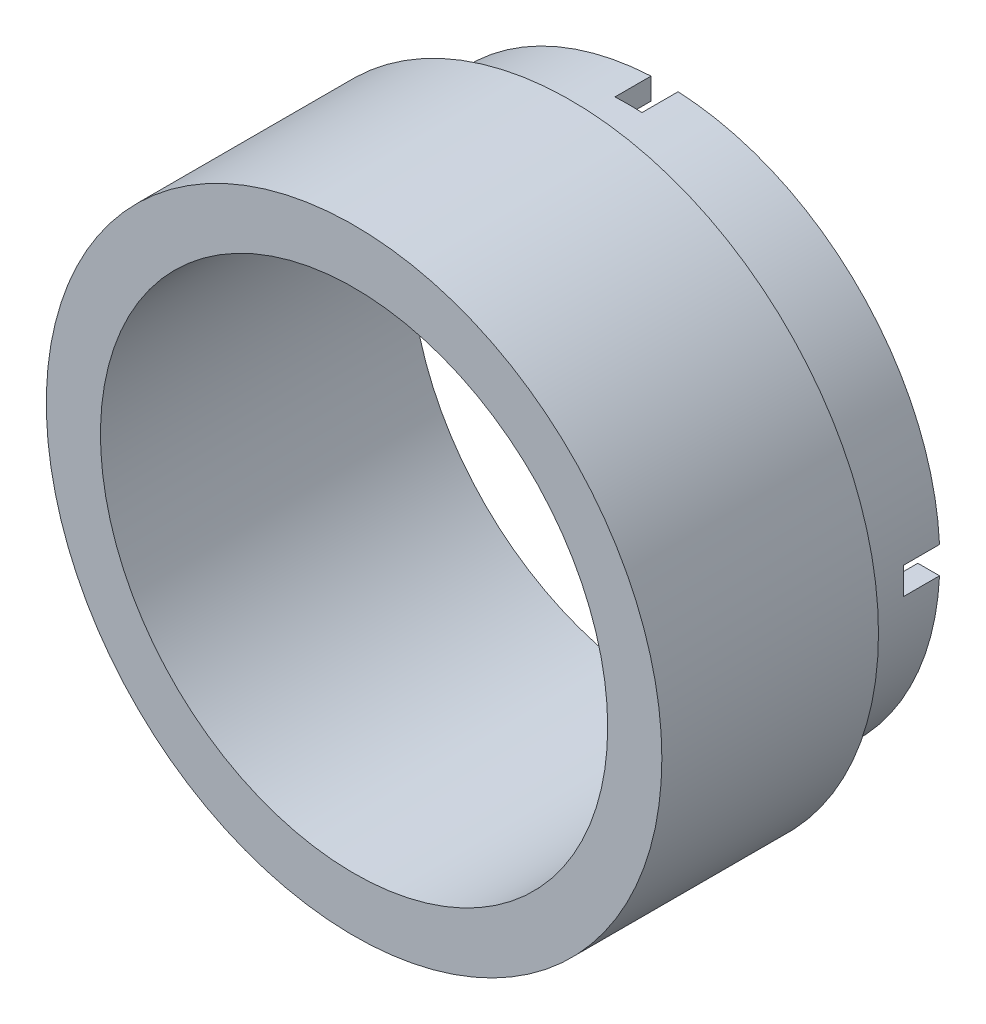
ISO-10303-21;
HEADER;
FILE_DESCRIPTION(('STEP AP214'),'2;1');
FILE_NAME('part.step','',(''),(''),'','','');
FILE_SCHEMA(('AUTOMOTIVE_DESIGN { 1 0 10303 214 1 1 1 1 }'));
ENDSEC;
DATA;
#1=APPLICATION_CONTEXT('core data for automotive mechanical design processes');
#2=APPLICATION_PROTOCOL_DEFINITION('international standard','automotive_design',2000,#1);
#3=PRODUCT_CONTEXT('',#1,'mechanical');
#4=PRODUCT('Part','Part','',(#3));
#5=PRODUCT_RELATED_PRODUCT_CATEGORY('part','',(#4));
#6=PRODUCT_DEFINITION_FORMATION('','',#4);
#7=PRODUCT_DEFINITION_CONTEXT('part definition',#1,'design');
#8=PRODUCT_DEFINITION('design','',#6,#7);
#9=PRODUCT_DEFINITION_SHAPE('','',#8);
#10=(LENGTH_UNIT() NAMED_UNIT(*) SI_UNIT(.MILLI.,.METRE.));
#11=(NAMED_UNIT(*) PLANE_ANGLE_UNIT() SI_UNIT($,.RADIAN.));
#12=(NAMED_UNIT(*) SI_UNIT($,.STERADIAN.) SOLID_ANGLE_UNIT());
#13=UNCERTAINTY_MEASURE_WITH_UNIT(LENGTH_MEASURE(1.E-05),#10,'distance_accuracy_value','');
#14=(GEOMETRIC_REPRESENTATION_CONTEXT(3) GLOBAL_UNCERTAINTY_ASSIGNED_CONTEXT((#13)) GLOBAL_UNIT_ASSIGNED_CONTEXT((#10,
#11,#12)) REPRESENTATION_CONTEXT('',''));
#15=CARTESIAN_POINT('',(0.,0.,0.));
#16=DIRECTION('',(0.,0.,1.));
#17=DIRECTION('',(1.,0.,0.));
#18=AXIS2_PLACEMENT_3D('',#15,#16,#17);
#19=CARTESIAN_POINT('',(0.,0.,0.));
#20=DIRECTION('',(0.,0.,1.));
#21=DIRECTION('',(1.,0.,0.));
#22=AXIS2_PLACEMENT_3D('',#19,#20,#21);
#23=PLANE('',#22);
#24=DIRECTION('',(0.,1.,0.));
#25=VECTOR('',#24,1.);
#26=CARTESIAN_POINT('',(0.749999999999999,-0.749999999999974,0.));
#27=LINE('',#26,#25);
#28=CARTESIAN_POINT('',(0.750000000000001,-15.2315462117278,0.));
#29=VERTEX_POINT('',#28);
#30=CARTESIAN_POINT('',(0.750000000000001,-14.0299679258365,0.));
#31=VERTEX_POINT('',#30);
#32=EDGE_CURVE('E152',#29,#31,#27,.T.);
#33=ORIENTED_EDGE('',*,*,#32,.T.);
#34=CARTESIAN_POINT('',(0.,0.,0.));
#35=DIRECTION('',(0.,0.,1.));
#36=DIRECTION('',(1.,0.,0.));
#37=AXIS2_PLACEMENT_3D('',#34,#35,#36);
#38=CIRCLE('',#37,14.05);
#39=CARTESIAN_POINT('',(14.0299679258365,-0.749999999999973,0.));
#40=VERTEX_POINT('',#39);
#41=EDGE_CURVE('E177',#31,#40,#38,.T.);
#42=ORIENTED_EDGE('',*,*,#41,.T.);
#43=DIRECTION('',(1.,0.,0.));
#44=VECTOR('',#43,1.);
#45=CARTESIAN_POINT('',(0.749999999999999,-0.749999999999974,0.));
#46=LINE('',#45,#44);
#47=CARTESIAN_POINT('',(15.2315462117278,-0.749999999999972,0.));
#48=VERTEX_POINT('',#47);
#49=EDGE_CURVE('E165',#40,#48,#46,.T.);
#50=ORIENTED_EDGE('',*,*,#49,.T.);
#51=CARTESIAN_POINT('',(0.,0.,0.));
#52=DIRECTION('',(0.,0.,1.));
#53=DIRECTION('',(1.,0.,0.));
#54=AXIS2_PLACEMENT_3D('',#51,#52,#53);
#55=CIRCLE('',#54,15.25);
#56=EDGE_CURVE('E173',#29,#48,#55,.T.);
#57=ORIENTED_EDGE('',*,*,#56,.F.);
#58=EDGE_LOOP('',(#33,#42,#50,#57));
#59=FACE_BOUND('',#58,.T.);
#60=ADVANCED_FACE('F39',(#59),#23,.F.);
#61=DIRECTION('',(-1.,0.,0.));
#62=VECTOR('',#61,1.);
#63=CARTESIAN_POINT('',(0.749999999999997,0.750000000000029,0.));
#64=LINE('',#63,#62);
#65=CARTESIAN_POINT('',(15.2315462117278,0.750000000000028,0.));
#66=VERTEX_POINT('',#65);
#67=CARTESIAN_POINT('',(14.0299679258365,0.750000000000028,0.));
#68=VERTEX_POINT('',#67);
#69=EDGE_CURVE('E298',#66,#68,#64,.T.);
#70=ORIENTED_EDGE('',*,*,#69,.T.);
#71=CARTESIAN_POINT('',(0.749999999999997,14.0299679258365,0.));
#72=VERTEX_POINT('',#71);
#73=EDGE_CURVE('E183',#68,#72,#38,.T.);
#74=ORIENTED_EDGE('',*,*,#73,.T.);
#75=DIRECTION('',(0.,1.,0.));
#76=VECTOR('',#75,1.);
#77=CARTESIAN_POINT('',(0.749999999999997,17.4512535008235,0.));
#78=LINE('',#77,#76);
#79=CARTESIAN_POINT('',(0.749999999999997,15.2315462117278,0.));
#80=VERTEX_POINT('',#79);
#81=EDGE_CURVE('E230',#72,#80,#78,.T.);
#82=ORIENTED_EDGE('',*,*,#81,.T.);
#83=EDGE_CURVE('E185',#66,#80,#55,.T.);
#84=ORIENTED_EDGE('',*,*,#83,.F.);
#85=EDGE_LOOP('',(#70,#74,#82,#84));
#86=FACE_BOUND('',#85,.T.);
#87=ADVANCED_FACE('F304',(#86),#23,.F.);
#88=DIRECTION('',(0.,-1.,0.));
#89=VECTOR('',#88,1.);
#90=CARTESIAN_POINT('',(-0.750000000000003,17.4512535008235,0.));
#91=LINE('',#90,#89);
#92=CARTESIAN_POINT('',(-0.750000000000003,15.2315462117278,0.));
#93=VERTEX_POINT('',#92);
#94=CARTESIAN_POINT('',(-0.750000000000003,14.0299679258365,0.));
#95=VERTEX_POINT('',#94);
#96=EDGE_CURVE('E217',#93,#95,#91,.T.);
#97=ORIENTED_EDGE('',*,*,#96,.T.);
#98=CARTESIAN_POINT('',(-14.0299679258365,0.750000000000028,0.));
#99=VERTEX_POINT('',#98);
#100=EDGE_CURVE('E191',#95,#99,#38,.T.);
#101=ORIENTED_EDGE('',*,*,#100,.T.);
#102=DIRECTION('',(-1.,0.,0.));
#103=VECTOR('',#102,1.);
#104=CARTESIAN_POINT('',(-21.8765202372286,0.750000000000028,0.));
#105=LINE('',#104,#103);
#106=CARTESIAN_POINT('',(-15.2315462117278,0.750000000000028,0.));
#107=VERTEX_POINT('',#106);
#108=EDGE_CURVE('E219',#99,#107,#105,.T.);
#109=ORIENTED_EDGE('',*,*,#108,.T.);
#110=EDGE_CURVE('E189',#93,#107,#55,.T.);
#111=ORIENTED_EDGE('',*,*,#110,.F.);
#112=EDGE_LOOP('',(#97,#101,#109,#111));
#113=FACE_BOUND('',#112,.T.);
#114=ADVANCED_FACE('F215',(#113),#23,.F.);
#115=DIRECTION('',(1.,0.,0.));
#116=VECTOR('',#115,1.);
#117=CARTESIAN_POINT('',(-21.8765202372286,-0.749999999999972,0.));
#118=LINE('',#117,#116);
#119=CARTESIAN_POINT('',(-15.2315462117278,-0.749999999999972,0.));
#120=VERTEX_POINT('',#119);
#121=CARTESIAN_POINT('',(-14.0299679258365,-0.749999999999972,0.));
#122=VERTEX_POINT('',#121);
#123=EDGE_CURVE('E223',#120,#122,#118,.T.);
#124=ORIENTED_EDGE('',*,*,#123,.T.);
#125=CARTESIAN_POINT('',(-0.749999999999999,-14.0299679258365,0.));
#126=VERTEX_POINT('',#125);
#127=EDGE_CURVE('E346',#122,#126,#38,.T.);
#128=ORIENTED_EDGE('',*,*,#127,.T.);
#129=DIRECTION('',(0.,-1.,0.));
#130=VECTOR('',#129,1.);
#131=CARTESIAN_POINT('',(-0.750000000000001,-0.749999999999972,0.));
#132=LINE('',#131,#130);
#133=CARTESIAN_POINT('',(-0.749999999999999,-15.2315462117278,0.));
#134=VERTEX_POINT('',#133);
#135=EDGE_CURVE('E228',#126,#134,#132,.T.);
#136=ORIENTED_EDGE('',*,*,#135,.T.);
#137=EDGE_CURVE('E182',#120,#134,#55,.T.);
#138=ORIENTED_EDGE('',*,*,#137,.F.);
#139=EDGE_LOOP('',(#124,#128,#136,#138));
#140=FACE_BOUND('',#139,.T.);
#141=ADVANCED_FACE('F353',(#140),#23,.F.);
#142=CARTESIAN_POINT('',(0.,0.,5.2));
#143=DIRECTION('',(0.,0.,-1.));
#144=DIRECTION('',(-1.,0.,0.));
#145=AXIS2_PLACEMENT_3D('',#142,#143,#144);
#146=CYLINDRICAL_SURFACE('',#145,15.25);
#147=CARTESIAN_POINT('',(0.,0.,5.2));
#148=DIRECTION('',(0.,0.,1.));
#149=DIRECTION('',(1.,0.,0.));
#150=AXIS2_PLACEMENT_3D('',#147,#148,#149);
#151=CIRCLE('',#150,15.25);
#152=CARTESIAN_POINT('',(15.25,0.,5.2));
#153=VERTEX_POINT('',#152);
#154=EDGE_CURVE('E197',#153,#153,#151,.T.);
#155=ORIENTED_EDGE('',*,*,#154,.F.);
#156=EDGE_LOOP('',(#155));
#157=FACE_BOUND('',#156,.T.);
#158=DIRECTION('',(0.,0.,-1.));
#159=VECTOR('',#158,1.);
#160=CARTESIAN_POINT('',(0.749999999999997,15.2315462117278,5.2));
#161=LINE('',#160,#159);
#162=CARTESIAN_POINT('',(0.749999999999997,15.2315462117278,2.));
#163=VERTEX_POINT('',#162);
#164=EDGE_CURVE('E254',#163,#80,#161,.T.);
#165=ORIENTED_EDGE('',*,*,#164,.F.);
#166=CARTESIAN_POINT('',(0.,0.,2.));
#167=DIRECTION('',(0.,0.,1.));
#168=DIRECTION('',(1.,0.,0.));
#169=AXIS2_PLACEMENT_3D('',#166,#167,#168);
#170=CIRCLE('',#169,15.25);
#171=CARTESIAN_POINT('',(-0.750000000000003,15.2315462117278,2.));
#172=VERTEX_POINT('',#171);
#173=EDGE_CURVE('E243',#163,#172,#170,.T.);
#174=ORIENTED_EDGE('',*,*,#173,.T.);
#175=DIRECTION('',(0.,0.,-1.));
#176=VECTOR('',#175,1.);
#177=CARTESIAN_POINT('',(-0.750000000000003,15.2315462117278,5.2));
#178=LINE('',#177,#176);
#179=EDGE_CURVE('E211',#93,#172,#178,.F.);
#180=ORIENTED_EDGE('',*,*,#179,.F.);
#181=ORIENTED_EDGE('',*,*,#110,.T.);
#182=DIRECTION('',(0.,0.,-1.));
#183=VECTOR('',#182,1.);
#184=CARTESIAN_POINT('',(-15.2315462117278,0.750000000000028,5.2));
#185=LINE('',#184,#183);
#186=CARTESIAN_POINT('',(-15.2315462117278,0.750000000000028,2.));
#187=VERTEX_POINT('',#186);
#188=EDGE_CURVE('E209',#187,#107,#185,.T.);
#189=ORIENTED_EDGE('',*,*,#188,.F.);
#190=CARTESIAN_POINT('',(-15.2315462117278,-0.749999999999972,2.));
#191=VERTEX_POINT('',#190);
#192=EDGE_CURVE('E354',#187,#191,#170,.T.);
#193=ORIENTED_EDGE('',*,*,#192,.T.);
#194=DIRECTION('',(0.,0.,-1.));
#195=VECTOR('',#194,1.);
#196=CARTESIAN_POINT('',(-15.2315462117278,-0.749999999999972,5.2));
#197=LINE('',#196,#195);
#198=EDGE_CURVE('E247',#120,#191,#197,.F.);
#199=ORIENTED_EDGE('',*,*,#198,.F.);
#200=ORIENTED_EDGE('',*,*,#137,.T.);
#201=DIRECTION('',(0.,0.,-1.));
#202=VECTOR('',#201,1.);
#203=CARTESIAN_POINT('',(-0.749999999999999,-15.2315462117278,5.2));
#204=LINE('',#203,#202);
#205=CARTESIAN_POINT('',(-0.749999999999999,-15.2315462117278,2.));
#206=VERTEX_POINT('',#205);
#207=EDGE_CURVE('E244',#206,#134,#204,.T.);
#208=ORIENTED_EDGE('',*,*,#207,.F.);
#209=CARTESIAN_POINT('',(0.750000000000001,-15.2315462117278,2.));
#210=VERTEX_POINT('',#209);
#211=EDGE_CURVE('E175',#206,#210,#170,.T.);
#212=ORIENTED_EDGE('',*,*,#211,.T.);
#213=DIRECTION('',(0.,0.,-1.));
#214=VECTOR('',#213,1.);
#215=CARTESIAN_POINT('',(0.750000000000001,-15.2315462117278,5.2));
#216=LINE('',#215,#214);
#217=EDGE_CURVE('E156',#29,#210,#216,.F.);
#218=ORIENTED_EDGE('',*,*,#217,.F.);
#219=ORIENTED_EDGE('',*,*,#56,.T.);
#220=DIRECTION('',(0.,0.,-1.));
#221=VECTOR('',#220,1.);
#222=CARTESIAN_POINT('',(15.2315462117278,-0.749999999999972,5.2));
#223=LINE('',#222,#221);
#224=CARTESIAN_POINT('',(15.2315462117278,-0.749999999999972,2.));
#225=VERTEX_POINT('',#224);
#226=EDGE_CURVE('E178',#225,#48,#223,.T.);
#227=ORIENTED_EDGE('',*,*,#226,.F.);
#228=CARTESIAN_POINT('',(15.2315462117278,0.750000000000028,2.));
#229=VERTEX_POINT('',#228);
#230=EDGE_CURVE('E238',#225,#229,#170,.T.);
#231=ORIENTED_EDGE('',*,*,#230,.T.);
#232=DIRECTION('',(0.,0.,-1.));
#233=VECTOR('',#232,1.);
#234=CARTESIAN_POINT('',(15.2315462117278,0.750000000000028,5.2));
#235=LINE('',#234,#233);
#236=EDGE_CURVE('E257',#66,#229,#235,.F.);
#237=ORIENTED_EDGE('',*,*,#236,.F.);
#238=ORIENTED_EDGE('',*,*,#83,.T.);
#239=EDGE_LOOP('',(#165,#174,#180,#181,#189,#193,#199,#200,#208,#212,#218,#219,#227,#231,#237,#238));
#240=FACE_BOUND('',#239,.T.);
#241=ADVANCED_FACE('F41',(#157,#240),#146,.T.);
#242=CARTESIAN_POINT('',(0.,0.,5.2));
#243=DIRECTION('',(0.,0.,-1.));
#244=DIRECTION('',(-1.,0.,0.));
#245=AXIS2_PLACEMENT_3D('',#242,#243,#244);
#246=CYLINDRICAL_SURFACE('',#245,14.05);
#247=CARTESIAN_POINT('',(0.,0.,2.));
#248=DIRECTION('',(0.,0.,1.));
#249=DIRECTION('',(1.,0.,0.));
#250=AXIS2_PLACEMENT_3D('',#247,#248,#249);
#251=CIRCLE('',#250,14.05);
#252=CARTESIAN_POINT('',(0.749999999999997,14.0299679258365,2.));
#253=VERTEX_POINT('',#252);
#254=CARTESIAN_POINT('',(-0.750000000000003,14.0299679258365,2.));
#255=VERTEX_POINT('',#254);
#256=EDGE_CURVE('E313',#253,#255,#251,.T.);
#257=ORIENTED_EDGE('',*,*,#256,.F.);
#258=DIRECTION('',(0.,0.,-1.));
#259=VECTOR('',#258,1.);
#260=CARTESIAN_POINT('',(0.749999999999997,14.0299679258365,5.2));
#261=LINE('',#260,#259);
#262=EDGE_CURVE('E11',#253,#72,#261,.T.);
#263=ORIENTED_EDGE('',*,*,#262,.T.);
#264=ORIENTED_EDGE('',*,*,#73,.F.);
#265=DIRECTION('',(0.,0.,-1.));
#266=VECTOR('',#265,1.);
#267=CARTESIAN_POINT('',(14.0299679258365,0.750000000000028,5.2));
#268=LINE('',#267,#266);
#269=CARTESIAN_POINT('',(14.0299679258365,0.750000000000028,2.));
#270=VERTEX_POINT('',#269);
#271=EDGE_CURVE('E326',#68,#270,#268,.F.);
#272=ORIENTED_EDGE('',*,*,#271,.T.);
#273=CARTESIAN_POINT('',(14.0299679258365,-0.749999999999973,2.));
#274=VERTEX_POINT('',#273);
#275=EDGE_CURVE('E203',#274,#270,#251,.T.);
#276=ORIENTED_EDGE('',*,*,#275,.F.);
#277=DIRECTION('',(0.,0.,-1.));
#278=VECTOR('',#277,1.);
#279=CARTESIAN_POINT('',(14.0299679258365,-0.749999999999973,5.2));
#280=LINE('',#279,#278);
#281=EDGE_CURVE('E328',#274,#40,#280,.T.);
#282=ORIENTED_EDGE('',*,*,#281,.T.);
#283=ORIENTED_EDGE('',*,*,#41,.F.);
#284=DIRECTION('',(0.,0.,-1.));
#285=VECTOR('',#284,1.);
#286=CARTESIAN_POINT('',(0.750000000000001,-14.0299679258365,5.2));
#287=LINE('',#286,#285);
#288=CARTESIAN_POINT('',(0.750000000000001,-14.0299679258365,2.));
#289=VERTEX_POINT('',#288);
#290=EDGE_CURVE('E159',#31,#289,#287,.F.);
#291=ORIENTED_EDGE('',*,*,#290,.T.);
#292=CARTESIAN_POINT('',(-0.749999999999999,-14.0299679258365,2.));
#293=VERTEX_POINT('',#292);
#294=EDGE_CURVE('E324',#293,#289,#251,.T.);
#295=ORIENTED_EDGE('',*,*,#294,.F.);
#296=DIRECTION('',(0.,0.,-1.));
#297=VECTOR('',#296,1.);
#298=CARTESIAN_POINT('',(-0.749999999999999,-14.0299679258365,5.2));
#299=LINE('',#298,#297);
#300=EDGE_CURVE('E330',#293,#126,#299,.T.);
#301=ORIENTED_EDGE('',*,*,#300,.T.);
#302=ORIENTED_EDGE('',*,*,#127,.F.);
#303=DIRECTION('',(0.,0.,-1.));
#304=VECTOR('',#303,1.);
#305=CARTESIAN_POINT('',(-14.0299679258365,-0.749999999999972,5.2));
#306=LINE('',#305,#304);
#307=CARTESIAN_POINT('',(-14.0299679258365,-0.749999999999972,2.));
#308=VERTEX_POINT('',#307);
#309=EDGE_CURVE('E320',#122,#308,#306,.F.);
#310=ORIENTED_EDGE('',*,*,#309,.T.);
#311=CARTESIAN_POINT('',(-14.0299679258365,0.750000000000028,2.));
#312=VERTEX_POINT('',#311);
#313=EDGE_CURVE('E317',#312,#308,#251,.T.);
#314=ORIENTED_EDGE('',*,*,#313,.F.);
#315=DIRECTION('',(0.,0.,-1.));
#316=VECTOR('',#315,1.);
#317=CARTESIAN_POINT('',(-14.0299679258365,0.750000000000028,5.2));
#318=LINE('',#317,#316);
#319=EDGE_CURVE('E316',#312,#99,#318,.T.);
#320=ORIENTED_EDGE('',*,*,#319,.T.);
#321=ORIENTED_EDGE('',*,*,#100,.F.);
#322=DIRECTION('',(0.,0.,-1.));
#323=VECTOR('',#322,1.);
#324=CARTESIAN_POINT('',(-0.750000000000003,14.0299679258365,5.2));
#325=LINE('',#324,#323);
#326=EDGE_CURVE('E48',#95,#255,#325,.F.);
#327=ORIENTED_EDGE('',*,*,#326,.T.);
#328=EDGE_LOOP('',(#257,#263,#264,#272,#276,#282,#283,#291,#295,#301,#302,#310,#314,#320,#321,#327));
#329=FACE_BOUND('',#328,.T.);
#330=CARTESIAN_POINT('',(0.,0.,17.2));
#331=DIRECTION('',(0.,0.,1.));
#332=DIRECTION('',(1.,0.,0.));
#333=AXIS2_PLACEMENT_3D('',#330,#331,#332);
#334=CIRCLE('',#333,14.05);
#335=CARTESIAN_POINT('',(14.05,0.,17.2));
#336=VERTEX_POINT('',#335);
#337=EDGE_CURVE('E528',#336,#336,#334,.T.);
#338=ORIENTED_EDGE('',*,*,#337,.T.);
#339=EDGE_LOOP('',(#338));
#340=FACE_BOUND('',#339,.T.);
#341=ADVANCED_FACE('F310',(#329,#340),#246,.F.);
#342=CARTESIAN_POINT('',(0.,0.,2.));
#343=DIRECTION('',(0.,0.,1.));
#344=DIRECTION('',(1.,0.,0.));
#345=AXIS2_PLACEMENT_3D('',#342,#343,#344);
#346=PLANE('',#345);
#347=DIRECTION('',(1.,0.,0.));
#348=VECTOR('',#347,1.);
#349=CARTESIAN_POINT('',(0.749999999999999,-0.749999999999974,2.));
#350=LINE('',#349,#348);
#351=EDGE_CURVE('E266',#274,#225,#350,.T.);
#352=ORIENTED_EDGE('',*,*,#351,.F.);
#353=ORIENTED_EDGE('',*,*,#275,.T.);
#354=DIRECTION('',(-1.,0.,0.));
#355=VECTOR('',#354,1.);
#356=CARTESIAN_POINT('',(0.749999999999997,0.750000000000029,2.));
#357=LINE('',#356,#355);
#358=EDGE_CURVE('E271',#229,#270,#357,.T.);
#359=ORIENTED_EDGE('',*,*,#358,.F.);
#360=ORIENTED_EDGE('',*,*,#230,.F.);
#361=EDGE_LOOP('',(#352,#353,#359,#360));
#362=FACE_BOUND('',#361,.T.);
#363=ADVANCED_FACE('F269',(#362),#346,.F.);
#364=CARTESIAN_POINT('',(0.749999999999997,0.750000000000029,2.));
#365=DIRECTION('',(0.,-1.,0.));
#366=DIRECTION('',(1.,0.,0.));
#367=AXIS2_PLACEMENT_3D('',#364,#365,#366);
#368=PLANE('',#367);
#369=ORIENTED_EDGE('',*,*,#236,.T.);
#370=ORIENTED_EDGE('',*,*,#358,.T.);
#371=ORIENTED_EDGE('',*,*,#271,.F.);
#372=ORIENTED_EDGE('',*,*,#69,.F.);
#373=EDGE_LOOP('',(#369,#370,#371,#372));
#374=FACE_BOUND('',#373,.T.);
#375=ADVANCED_FACE('F411',(#374),#368,.T.);
#376=CARTESIAN_POINT('',(0.749999999999999,-0.749999999999974,2.));
#377=DIRECTION('',(0.,1.,0.));
#378=DIRECTION('',(-1.,0.,0.));
#379=AXIS2_PLACEMENT_3D('',#376,#377,#378);
#380=PLANE('',#379);
#381=ORIENTED_EDGE('',*,*,#226,.T.);
#382=ORIENTED_EDGE('',*,*,#49,.F.);
#383=ORIENTED_EDGE('',*,*,#281,.F.);
#384=ORIENTED_EDGE('',*,*,#351,.T.);
#385=EDGE_LOOP('',(#381,#382,#383,#384));
#386=FACE_BOUND('',#385,.T.);
#387=ADVANCED_FACE('F263',(#386),#380,.T.);
#388=DIRECTION('',(0.,-1.,0.));
#389=VECTOR('',#388,1.);
#390=CARTESIAN_POINT('',(-0.750000000000001,-0.749999999999972,2.));
#391=LINE('',#390,#389);
#392=EDGE_CURVE('E242',#293,#206,#391,.T.);
#393=ORIENTED_EDGE('',*,*,#392,.F.);
#394=ORIENTED_EDGE('',*,*,#294,.T.);
#395=DIRECTION('',(0.,1.,0.));
#396=VECTOR('',#395,1.);
#397=CARTESIAN_POINT('',(0.749999999999999,-0.749999999999974,2.));
#398=LINE('',#397,#396);
#399=EDGE_CURVE('E237',#210,#289,#398,.T.);
#400=ORIENTED_EDGE('',*,*,#399,.F.);
#401=ORIENTED_EDGE('',*,*,#211,.F.);
#402=EDGE_LOOP('',(#393,#394,#400,#401));
#403=FACE_BOUND('',#402,.T.);
#404=ADVANCED_FACE('F364',(#403),#346,.F.);
#405=CARTESIAN_POINT('',(-0.750000000000001,-0.749999999999972,2.));
#406=DIRECTION('',(1.,0.,0.));
#407=DIRECTION('',(0.,1.,0.));
#408=AXIS2_PLACEMENT_3D('',#405,#406,#407);
#409=PLANE('',#408);
#410=ORIENTED_EDGE('',*,*,#207,.T.);
#411=ORIENTED_EDGE('',*,*,#135,.F.);
#412=ORIENTED_EDGE('',*,*,#300,.F.);
#413=ORIENTED_EDGE('',*,*,#392,.T.);
#414=EDGE_LOOP('',(#410,#411,#412,#413));
#415=FACE_BOUND('',#414,.T.);
#416=ADVANCED_FACE('F363',(#415),#409,.T.);
#417=CARTESIAN_POINT('',(0.749999999999999,-0.749999999999974,2.));
#418=DIRECTION('',(-1.,0.,0.));
#419=DIRECTION('',(0.,-1.,0.));
#420=AXIS2_PLACEMENT_3D('',#417,#418,#419);
#421=PLANE('',#420);
#422=ORIENTED_EDGE('',*,*,#217,.T.);
#423=ORIENTED_EDGE('',*,*,#399,.T.);
#424=ORIENTED_EDGE('',*,*,#290,.F.);
#425=ORIENTED_EDGE('',*,*,#32,.F.);
#426=EDGE_LOOP('',(#422,#423,#424,#425));
#427=FACE_BOUND('',#426,.T.);
#428=ADVANCED_FACE('F154',(#427),#421,.T.);
#429=DIRECTION('',(-1.,0.,0.));
#430=VECTOR('',#429,1.);
#431=CARTESIAN_POINT('',(-21.8765202372286,0.750000000000028,2.));
#432=LINE('',#431,#430);
#433=EDGE_CURVE('E63',#312,#187,#432,.T.);
#434=ORIENTED_EDGE('',*,*,#433,.F.);
#435=ORIENTED_EDGE('',*,*,#313,.T.);
#436=DIRECTION('',(1.,0.,0.));
#437=VECTOR('',#436,1.);
#438=CARTESIAN_POINT('',(-21.8765202372286,-0.749999999999972,2.));
#439=LINE('',#438,#437);
#440=EDGE_CURVE('E289',#191,#308,#439,.T.);
#441=ORIENTED_EDGE('',*,*,#440,.F.);
#442=ORIENTED_EDGE('',*,*,#192,.F.);
#443=EDGE_LOOP('',(#434,#435,#441,#442));
#444=FACE_BOUND('',#443,.T.);
#445=ADVANCED_FACE('F355',(#444),#346,.F.);
#446=CARTESIAN_POINT('',(-21.8765202372286,-0.749999999999972,2.));
#447=DIRECTION('',(0.,1.,0.));
#448=DIRECTION('',(-1.,0.,0.));
#449=AXIS2_PLACEMENT_3D('',#446,#447,#448);
#450=PLANE('',#449);
#451=ORIENTED_EDGE('',*,*,#198,.T.);
#452=ORIENTED_EDGE('',*,*,#440,.T.);
#453=ORIENTED_EDGE('',*,*,#309,.F.);
#454=ORIENTED_EDGE('',*,*,#123,.F.);
#455=EDGE_LOOP('',(#451,#452,#453,#454));
#456=FACE_BOUND('',#455,.T.);
#457=ADVANCED_FACE('F348',(#456),#450,.T.);
#458=CARTESIAN_POINT('',(-21.8765202372286,0.750000000000028,2.));
#459=DIRECTION('',(0.,-1.,0.));
#460=DIRECTION('',(1.,0.,0.));
#461=AXIS2_PLACEMENT_3D('',#458,#459,#460);
#462=PLANE('',#461);
#463=ORIENTED_EDGE('',*,*,#188,.T.);
#464=ORIENTED_EDGE('',*,*,#108,.F.);
#465=ORIENTED_EDGE('',*,*,#319,.F.);
#466=ORIENTED_EDGE('',*,*,#433,.T.);
#467=EDGE_LOOP('',(#463,#464,#465,#466));
#468=FACE_BOUND('',#467,.T.);
#469=ADVANCED_FACE('F357',(#468),#462,.T.);
#470=CARTESIAN_POINT('',(0.749999999999997,17.4512535008235,2.));
#471=DIRECTION('',(-1.,0.,0.));
#472=DIRECTION('',(0.,-1.,0.));
#473=AXIS2_PLACEMENT_3D('',#470,#471,#472);
#474=PLANE('',#473);
#475=ORIENTED_EDGE('',*,*,#164,.T.);
#476=ORIENTED_EDGE('',*,*,#81,.F.);
#477=ORIENTED_EDGE('',*,*,#262,.F.);
#478=DIRECTION('',(0.,1.,0.));
#479=VECTOR('',#478,1.);
#480=CARTESIAN_POINT('',(0.749999999999997,17.4512535008235,2.));
#481=LINE('',#480,#479);
#482=EDGE_CURVE('E55',#253,#163,#481,.T.);
#483=ORIENTED_EDGE('',*,*,#482,.T.);
#484=EDGE_LOOP('',(#475,#476,#477,#483));
#485=FACE_BOUND('',#484,.T.);
#486=ADVANCED_FACE('F307',(#485),#474,.T.);
#487=CARTESIAN_POINT('',(-0.750000000000003,17.4512535008235,2.));
#488=DIRECTION('',(1.,0.,0.));
#489=DIRECTION('',(0.,1.,0.));
#490=AXIS2_PLACEMENT_3D('',#487,#488,#489);
#491=PLANE('',#490);
#492=ORIENTED_EDGE('',*,*,#179,.T.);
#493=DIRECTION('',(0.,-1.,0.));
#494=VECTOR('',#493,1.);
#495=CARTESIAN_POINT('',(-0.750000000000003,17.4512535008235,2.));
#496=LINE('',#495,#494);
#497=EDGE_CURVE('E279',#172,#255,#496,.T.);
#498=ORIENTED_EDGE('',*,*,#497,.T.);
#499=ORIENTED_EDGE('',*,*,#326,.F.);
#500=ORIENTED_EDGE('',*,*,#96,.F.);
#501=EDGE_LOOP('',(#492,#498,#499,#500));
#502=FACE_BOUND('',#501,.T.);
#503=ADVANCED_FACE('F369',(#502),#491,.T.);
#504=ORIENTED_EDGE('',*,*,#482,.F.);
#505=ORIENTED_EDGE('',*,*,#256,.T.);
#506=ORIENTED_EDGE('',*,*,#497,.F.);
#507=ORIENTED_EDGE('',*,*,#173,.F.);
#508=EDGE_LOOP('',(#504,#505,#506,#507));
#509=FACE_BOUND('',#508,.T.);
#510=ADVANCED_FACE('F367',(#509),#346,.F.);
#511=CARTESIAN_POINT('',(0.,0.,17.2));
#512=DIRECTION('',(0.,0.,1.));
#513=DIRECTION('',(1.,0.,0.));
#514=AXIS2_PLACEMENT_3D('',#511,#512,#513);
#515=PLANE('',#514);
#516=CARTESIAN_POINT('',(0.,0.,17.2));
#517=DIRECTION('',(0.,0.,1.));
#518=DIRECTION('',(1.,0.,0.));
#519=AXIS2_PLACEMENT_3D('',#516,#517,#518);
#520=CIRCLE('',#519,17.05);
#521=CARTESIAN_POINT('',(17.05,0.,17.2));
#522=VERTEX_POINT('',#521);
#523=EDGE_CURVE('E166',#522,#522,#520,.T.);
#524=ORIENTED_EDGE('',*,*,#523,.T.);
#525=EDGE_LOOP('',(#524));
#526=FACE_BOUND('',#525,.T.);
#527=ORIENTED_EDGE('',*,*,#337,.F.);
#528=EDGE_LOOP('',(#527));
#529=FACE_BOUND('',#528,.T.);
#530=ADVANCED_FACE('F376',(#526,#529),#515,.T.);
#531=CARTESIAN_POINT('',(0.,0.,5.2));
#532=DIRECTION('',(0.,0.,1.));
#533=DIRECTION('',(1.,0.,0.));
#534=AXIS2_PLACEMENT_3D('',#531,#532,#533);
#535=PLANE('',#534);
#536=ORIENTED_EDGE('',*,*,#154,.T.);
#537=EDGE_LOOP('',(#536));
#538=FACE_BOUND('',#537,.T.);
#539=CARTESIAN_POINT('',(0.,0.,5.2));
#540=DIRECTION('',(0.,0.,1.));
#541=DIRECTION('',(1.,0.,0.));
#542=AXIS2_PLACEMENT_3D('',#539,#540,#541);
#543=CIRCLE('',#542,17.05);
#544=CARTESIAN_POINT('',(17.05,0.,5.2));
#545=VERTEX_POINT('',#544);
#546=EDGE_CURVE('E525',#545,#545,#543,.T.);
#547=ORIENTED_EDGE('',*,*,#546,.F.);
#548=EDGE_LOOP('',(#547));
#549=FACE_BOUND('',#548,.T.);
#550=ADVANCED_FACE('F496',(#538,#549),#535,.F.);
#551=CARTESIAN_POINT('',(0.,0.,17.2));
#552=DIRECTION('',(0.,0.,-1.));
#553=DIRECTION('',(-1.,0.,0.));
#554=AXIS2_PLACEMENT_3D('',#551,#552,#553);
#555=CYLINDRICAL_SURFACE('',#554,17.05);
#556=ORIENTED_EDGE('',*,*,#523,.F.);
#557=EDGE_LOOP('',(#556));
#558=FACE_BOUND('',#557,.T.);
#559=ORIENTED_EDGE('',*,*,#546,.T.);
#560=EDGE_LOOP('',(#559));
#561=FACE_BOUND('',#560,.T.);
#562=ADVANCED_FACE('F505',(#558,#561),#555,.T.);
#563=CLOSED_SHELL('',(#60,#87,#114,#141,#241,#341,#363,#375,#387,#404,#416,#428,#445,#457,#469,
#486,#503,#510,#530,#550,#562));
#564=MANIFOLD_SOLID_BREP('B2',#563);
#565=ADVANCED_BREP_SHAPE_REPRESENTATION('',(#18,#564),#14);
#566=SHAPE_DEFINITION_REPRESENTATION(#9,#565);
ENDSEC;
END-ISO-10303-21;
